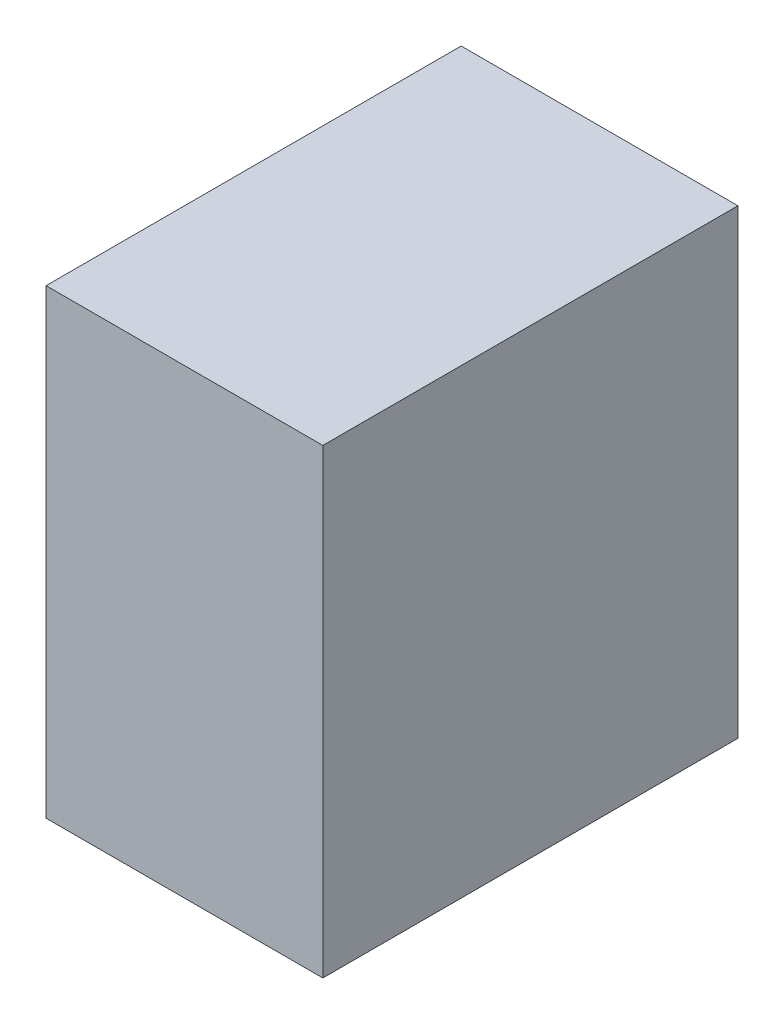
ISO-10303-21;
HEADER;
FILE_DESCRIPTION(('STEP AP214'),'2;1');
FILE_NAME('part.step','',(''),(''),'','','');
FILE_SCHEMA(('AUTOMOTIVE_DESIGN { 1 0 10303 214 1 1 1 1 }'));
ENDSEC;
DATA;
#1=APPLICATION_CONTEXT('core data for automotive mechanical design processes');
#2=APPLICATION_PROTOCOL_DEFINITION('international standard','automotive_design',2000,#1);
#3=PRODUCT_CONTEXT('',#1,'mechanical');
#4=PRODUCT('Part','Part','',(#3));
#5=PRODUCT_RELATED_PRODUCT_CATEGORY('part','',(#4));
#6=PRODUCT_DEFINITION_FORMATION('','',#4);
#7=PRODUCT_DEFINITION_CONTEXT('part definition',#1,'design');
#8=PRODUCT_DEFINITION('design','',#6,#7);
#9=PRODUCT_DEFINITION_SHAPE('','',#8);
#10=(LENGTH_UNIT() NAMED_UNIT(*) SI_UNIT(.MILLI.,.METRE.));
#11=(NAMED_UNIT(*) PLANE_ANGLE_UNIT() SI_UNIT($,.RADIAN.));
#12=(NAMED_UNIT(*) SI_UNIT($,.STERADIAN.) SOLID_ANGLE_UNIT());
#13=UNCERTAINTY_MEASURE_WITH_UNIT(LENGTH_MEASURE(1.E-05),#10,'distance_accuracy_value','');
#14=(GEOMETRIC_REPRESENTATION_CONTEXT(3) GLOBAL_UNCERTAINTY_ASSIGNED_CONTEXT((#13)) GLOBAL_UNIT_ASSIGNED_CONTEXT((#10,
#11,#12)) REPRESENTATION_CONTEXT('',''));
#15=CARTESIAN_POINT('',(0.,0.,0.));
#16=DIRECTION('',(0.,0.,1.));
#17=DIRECTION('',(1.,0.,0.));
#18=AXIS2_PLACEMENT_3D('',#15,#16,#17);
#19=CARTESIAN_POINT('',(3.29999968527802,-1.80000036280452,-3.30112136363507));
#20=DIRECTION('',(1.,-1.74845553146952E-07,0.));
#21=DIRECTION('',(1.74845553146952E-07,1.,-8.74227765734759E-08));
#22=AXIS2_PLACEMENT_3D('',#19,#20,#21);
#23=PLANE('',#22);
#24=DIRECTION('',(1.74845553146599E-07,0.999999999999981,-8.74227765732993E-08));
#25=VECTOR('',#24,1.);
#26=CARTESIAN_POINT('',(3.2999996940203,-1.75000035843338,-3.25112136800621));
#27=LINE('',#26,#25);
#28=CARTESIAN_POINT('',(3.2999996940213,-1.75000035843238,-3.25112136800621));
#29=VERTEX_POINT('',#28);
#30=CARTESIAN_POINT('',(3.29999986886685,-0.750000358431384,-3.25112145542799));
#31=VERTEX_POINT('',#30);
#32=EDGE_CURVE('E11',#29,#31,#27,.T.);
#33=ORIENTED_EDGE('',*,*,#32,.F.);
#34=DIRECTION('',(0.,-8.74227766721621E-08,-0.999999999999996));
#35=VECTOR('',#34,1.);
#36=CARTESIAN_POINT('',(3.29999969402031,-1.75000027975288,-2.35112136800621));
#37=LINE('',#36,#35);
#38=CARTESIAN_POINT('',(3.29999969402131,-1.75000027975288,-2.35112136800721));
#39=VERTEX_POINT('',#38);
#40=EDGE_CURVE('E59',#39,#29,#37,.T.);
#41=ORIENTED_EDGE('',*,*,#40,.F.);
#42=DIRECTION('',(-1.74845553146599E-07,-0.999999999999981,8.74227765732994E-08));
#43=VECTOR('',#42,1.);
#44=CARTESIAN_POINT('',(3.29999986886586,-0.750000279750885,-2.35112145542899));
#45=LINE('',#44,#43);
#46=CARTESIAN_POINT('',(3.29999986886686,-0.750000279751885,-2.35112145542899));
#47=VERTEX_POINT('',#46);
#48=EDGE_CURVE('E79',#47,#39,#45,.T.);
#49=ORIENTED_EDGE('',*,*,#48,.F.);
#50=DIRECTION('',(0.,8.7422776548804E-08,0.999999999999996));
#51=VECTOR('',#50,1.);
#52=CARTESIAN_POINT('',(3.29999986886585,-0.750000358431384,-3.25112145542899));
#53=LINE('',#52,#51);
#54=EDGE_CURVE('E84',#31,#47,#53,.T.);
#55=ORIENTED_EDGE('',*,*,#54,.F.);
#56=EDGE_LOOP('',(#33,#41,#49,#55));
#57=FACE_BOUND('',#56,.T.);
#58=ADVANCED_FACE('F17',(#57),#23,.F.);
#59=CARTESIAN_POINT('',(3.89999968527802,-1.80000046771185,-3.30112136363507));
#60=DIRECTION('',(1.,-1.74845553146952E-07,0.));
#61=DIRECTION('',(1.74845553146952E-07,1.,-8.74227765734759E-08));
#62=AXIS2_PLACEMENT_3D('',#59,#60,#61);
#63=PLANE('',#62);
#64=DIRECTION('',(0.,8.74227761787296E-08,0.999999999999996));
#65=VECTOR('',#64,1.);
#66=CARTESIAN_POINT('',(3.89999986886585,-0.750000463338715,-3.25112145542898));
#67=LINE('',#66,#65);
#68=CARTESIAN_POINT('',(3.89999986886485,-0.750000463338716,-3.25112145542798));
#69=VERTEX_POINT('',#68);
#70=CARTESIAN_POINT('',(3.89999986886486,-0.750000384659217,-2.35112145542898));
#71=VERTEX_POINT('',#70);
#72=EDGE_CURVE('E24',#69,#71,#67,.T.);
#73=ORIENTED_EDGE('',*,*,#72,.T.);
#74=DIRECTION('',(-1.74845553146599E-07,-0.999999999999981,8.74227765732993E-08));
#75=VECTOR('',#74,1.);
#76=CARTESIAN_POINT('',(3.89999986886586,-0.750000384658216,-2.35112145542898));
#77=LINE('',#76,#75);
#78=CARTESIAN_POINT('',(3.89999969401931,-1.75000038466022,-2.35112136800721));
#79=VERTEX_POINT('',#78);
#80=EDGE_CURVE('E82',#71,#79,#77,.T.);
#81=ORIENTED_EDGE('',*,*,#80,.T.);
#82=DIRECTION('',(0.,-8.7422776672162E-08,-0.999999999999996));
#83=VECTOR('',#82,1.);
#84=CARTESIAN_POINT('',(3.89999969402031,-1.75000038466022,-2.35112136800621));
#85=LINE('',#84,#83);
#86=CARTESIAN_POINT('',(3.8999996940193,-1.75000046333972,-3.2511213680062));
#87=VERTEX_POINT('',#86);
#88=EDGE_CURVE('E64',#79,#87,#85,.T.);
#89=ORIENTED_EDGE('',*,*,#88,.T.);
#90=DIRECTION('',(1.74845553146599E-07,0.999999999999981,-8.74227765732993E-08));
#91=VECTOR('',#90,1.);
#92=CARTESIAN_POINT('',(3.8999996940203,-1.75000046334072,-3.2511213680062));
#93=LINE('',#92,#91);
#94=EDGE_CURVE('E61',#87,#69,#93,.T.);
#95=ORIENTED_EDGE('',*,*,#94,.T.);
#96=EDGE_LOOP('',(#73,#81,#89,#95));
#97=FACE_BOUND('',#96,.T.);
#98=ADVANCED_FACE('F62',(#97),#63,.T.);
#99=CARTESIAN_POINT('',(3.29999986886585,-0.750000358431384,-3.25112145542899));
#100=DIRECTION('',(1.74845553146952E-07,1.,-8.74227765734759E-08));
#101=DIRECTION('',(0.,8.74227765734759E-08,1.));
#102=AXIS2_PLACEMENT_3D('',#99,#100,#101);
#103=PLANE('',#102);
#104=ORIENTED_EDGE('',*,*,#54,.T.);
#105=DIRECTION('',(0.999999999999985,-1.74845553220964E-07,0.));
#106=VECTOR('',#105,1.);
#107=CARTESIAN_POINT('',(3.29999986886586,-0.750000279750885,-2.35112145542899));
#108=LINE('',#107,#106);
#109=EDGE_CURVE('E57',#47,#71,#108,.T.);
#110=ORIENTED_EDGE('',*,*,#109,.T.);
#111=ORIENTED_EDGE('',*,*,#72,.F.);
#112=DIRECTION('',(0.999999999999985,-1.74845553220964E-07,0.));
#113=VECTOR('',#112,1.);
#114=CARTESIAN_POINT('',(3.29999986886585,-0.750000358431384,-3.25112145542899));
#115=LINE('',#114,#113);
#116=EDGE_CURVE('E55',#31,#69,#115,.T.);
#117=ORIENTED_EDGE('',*,*,#116,.F.);
#118=EDGE_LOOP('',(#104,#110,#111,#117));
#119=FACE_BOUND('',#118,.T.);
#120=ADVANCED_FACE('F53',(#119),#103,.T.);
#121=CARTESIAN_POINT('',(3.29999986886586,-0.750000279750885,-2.35112145542899));
#122=DIRECTION('',(0.,8.74227765734759E-08,1.));
#123=DIRECTION('',(-1.74845553146952E-07,-1.,8.74227765734759E-08));
#124=AXIS2_PLACEMENT_3D('',#121,#122,#123);
#125=PLANE('',#124);
#126=ORIENTED_EDGE('',*,*,#48,.T.);
#127=DIRECTION('',(0.999999999999985,-1.74845553220964E-07,0.));
#128=VECTOR('',#127,1.);
#129=CARTESIAN_POINT('',(3.29999969402031,-1.75000027975288,-2.35112136800621));
#130=LINE('',#129,#128);
#131=EDGE_CURVE('E68',#39,#79,#130,.T.);
#132=ORIENTED_EDGE('',*,*,#131,.T.);
#133=ORIENTED_EDGE('',*,*,#80,.F.);
#134=ORIENTED_EDGE('',*,*,#109,.F.);
#135=EDGE_LOOP('',(#126,#132,#133,#134));
#136=FACE_BOUND('',#135,.T.);
#137=ADVANCED_FACE('F91',(#136),#125,.T.);
#138=CARTESIAN_POINT('',(3.29999969402031,-1.75000027975288,-2.35112136800621));
#139=DIRECTION('',(-1.74845553146952E-07,-1.,8.74227765734759E-08));
#140=DIRECTION('',(0.,-8.74227765734759E-08,-1.));
#141=AXIS2_PLACEMENT_3D('',#138,#139,#140);
#142=PLANE('',#141);
#143=ORIENTED_EDGE('',*,*,#40,.T.);
#144=DIRECTION('',(0.999999999999985,-1.74845553220964E-07,0.));
#145=VECTOR('',#144,1.);
#146=CARTESIAN_POINT('',(3.2999996940203,-1.75000035843338,-3.25112136800621));
#147=LINE('',#146,#145);
#148=EDGE_CURVE('E69',#29,#87,#147,.T.);
#149=ORIENTED_EDGE('',*,*,#148,.T.);
#150=ORIENTED_EDGE('',*,*,#88,.F.);
#151=ORIENTED_EDGE('',*,*,#131,.F.);
#152=EDGE_LOOP('',(#143,#149,#150,#151));
#153=FACE_BOUND('',#152,.T.);
#154=ADVANCED_FACE('F88',(#153),#142,.T.);
#155=CARTESIAN_POINT('',(3.2999996940203,-1.75000035843338,-3.25112136800621));
#156=DIRECTION('',(0.,-8.74227765734759E-08,-1.));
#157=DIRECTION('',(1.74845553146952E-07,1.,-8.74227765734759E-08));
#158=AXIS2_PLACEMENT_3D('',#155,#156,#157);
#159=PLANE('',#158);
#160=ORIENTED_EDGE('',*,*,#32,.T.);
#161=ORIENTED_EDGE('',*,*,#116,.T.);
#162=ORIENTED_EDGE('',*,*,#94,.F.);
#163=ORIENTED_EDGE('',*,*,#148,.F.);
#164=EDGE_LOOP('',(#160,#161,#162,#163));
#165=FACE_BOUND('',#164,.T.);
#166=ADVANCED_FACE('F71',(#165),#159,.T.);
#167=CLOSED_SHELL('',(#58,#98,#120,#137,#154,#166));
#168=MANIFOLD_SOLID_BREP('B1',#167);
#169=ADVANCED_BREP_SHAPE_REPRESENTATION('',(#18,#168),#14);
#170=SHAPE_DEFINITION_REPRESENTATION(#9,#169);
ENDSEC;
END-ISO-10303-21;
